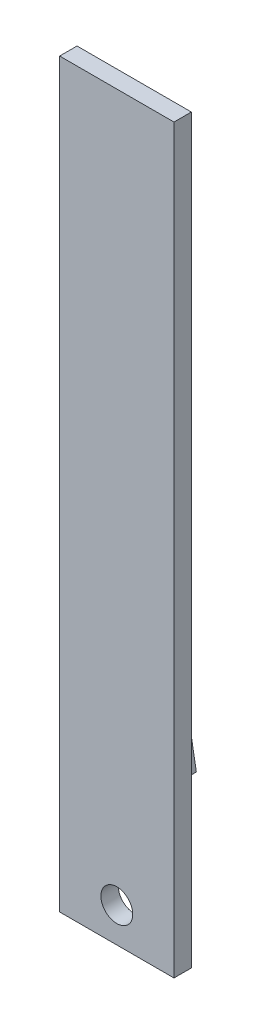
ISO-10303-21;
HEADER;
FILE_DESCRIPTION(('STEP AP214'),'2;1');
FILE_NAME('part.step','',(''),(''),'','','');
FILE_SCHEMA(('AUTOMOTIVE_DESIGN { 1 0 10303 214 1 1 1 1 }'));
ENDSEC;
DATA;
#1=APPLICATION_CONTEXT('core data for automotive mechanical design processes');
#2=APPLICATION_PROTOCOL_DEFINITION('international standard','automotive_design',2000,#1);
#3=PRODUCT_CONTEXT('',#1,'mechanical');
#4=PRODUCT('Part','Part','',(#3));
#5=PRODUCT_RELATED_PRODUCT_CATEGORY('part','',(#4));
#6=PRODUCT_DEFINITION_FORMATION('','',#4);
#7=PRODUCT_DEFINITION_CONTEXT('part definition',#1,'design');
#8=PRODUCT_DEFINITION('design','',#6,#7);
#9=PRODUCT_DEFINITION_SHAPE('','',#8);
#10=(LENGTH_UNIT() NAMED_UNIT(*) SI_UNIT(.MILLI.,.METRE.));
#11=(NAMED_UNIT(*) PLANE_ANGLE_UNIT() SI_UNIT($,.RADIAN.));
#12=(NAMED_UNIT(*) SI_UNIT($,.STERADIAN.) SOLID_ANGLE_UNIT());
#13=UNCERTAINTY_MEASURE_WITH_UNIT(LENGTH_MEASURE(1.E-05),#10,'distance_accuracy_value','');
#14=(GEOMETRIC_REPRESENTATION_CONTEXT(3) GLOBAL_UNCERTAINTY_ASSIGNED_CONTEXT((#13)) GLOBAL_UNIT_ASSIGNED_CONTEXT((#10,
#11,#12)) REPRESENTATION_CONTEXT('',''));
#15=CARTESIAN_POINT('',(0.,0.,0.));
#16=DIRECTION('',(0.,0.,1.));
#17=DIRECTION('',(1.,0.,0.));
#18=AXIS2_PLACEMENT_3D('',#15,#16,#17);
#19=CARTESIAN_POINT('',(0.,0.,3.175));
#20=DIRECTION('',(-1.,0.,0.));
#21=DIRECTION('',(0.,0.,1.));
#22=AXIS2_PLACEMENT_3D('',#19,#20,#21);
#23=PLANE('',#22);
#24=DIRECTION('',(0.,1.,0.));
#25=VECTOR('',#24,1.);
#26=CARTESIAN_POINT('',(0.,0.,0.));
#27=LINE('',#26,#25);
#28=CARTESIAN_POINT('',(0.,0.,0.));
#29=VERTEX_POINT('',#28);
#30=CARTESIAN_POINT('',(0.,135.476524453244,0.));
#31=VERTEX_POINT('',#30);
#32=EDGE_CURVE('E187',#29,#31,#27,.T.);
#33=ORIENTED_EDGE('',*,*,#32,.T.);
#34=DIRECTION('',(0.,0.,-1.));
#35=VECTOR('',#34,1.);
#36=CARTESIAN_POINT('',(0.,135.476524453244,3.175));
#37=LINE('',#36,#35);
#38=CARTESIAN_POINT('',(0.,135.476524453244,3.175));
#39=VERTEX_POINT('',#38);
#40=EDGE_CURVE('E54',#39,#31,#37,.T.);
#41=ORIENTED_EDGE('',*,*,#40,.F.);
#42=DIRECTION('',(0.,1.,0.));
#43=VECTOR('',#42,1.);
#44=CARTESIAN_POINT('',(0.,0.,3.175));
#45=LINE('',#44,#43);
#46=CARTESIAN_POINT('',(0.,0.,3.175));
#47=VERTEX_POINT('',#46);
#48=EDGE_CURVE('E176',#47,#39,#45,.T.);
#49=ORIENTED_EDGE('',*,*,#48,.F.);
#50=DIRECTION('',(0.,0.,-1.));
#51=VECTOR('',#50,1.);
#52=CARTESIAN_POINT('',(0.,0.,3.175));
#53=LINE('',#52,#51);
#54=EDGE_CURVE('E186',#47,#29,#53,.T.);
#55=ORIENTED_EDGE('',*,*,#54,.T.);
#56=EDGE_LOOP('',(#33,#41,#49,#55));
#57=FACE_BOUND('',#56,.T.);
#58=ADVANCED_FACE('F45',(#57),#23,.F.);
#59=CARTESIAN_POINT('',(0.,135.476524453244,3.175));
#60=DIRECTION('',(0.,-1.,0.));
#61=DIRECTION('',(0.,0.,-1.));
#62=AXIS2_PLACEMENT_3D('',#59,#60,#61);
#63=PLANE('',#62);
#64=DIRECTION('',(-1.,0.,0.));
#65=VECTOR('',#64,1.);
#66=CARTESIAN_POINT('',(0.,135.476524453244,0.));
#67=LINE('',#66,#65);
#68=CARTESIAN_POINT('',(-20.8947475915342,135.476524453244,0.));
#69=VERTEX_POINT('',#68);
#70=EDGE_CURVE('E191',#31,#69,#67,.T.);
#71=ORIENTED_EDGE('',*,*,#70,.T.);
#72=DIRECTION('',(0.,0.,-1.));
#73=VECTOR('',#72,1.);
#74=CARTESIAN_POINT('',(-20.8947475915342,135.476524453244,3.175));
#75=LINE('',#74,#73);
#76=CARTESIAN_POINT('',(-20.8947475915342,135.476524453244,3.175));
#77=VERTEX_POINT('',#76);
#78=EDGE_CURVE('E203',#77,#69,#75,.T.);
#79=ORIENTED_EDGE('',*,*,#78,.F.);
#80=DIRECTION('',(-1.,0.,0.));
#81=VECTOR('',#80,1.);
#82=CARTESIAN_POINT('',(0.,135.476524453244,3.175));
#83=LINE('',#82,#81);
#84=EDGE_CURVE('E94',#39,#77,#83,.T.);
#85=ORIENTED_EDGE('',*,*,#84,.F.);
#86=ORIENTED_EDGE('',*,*,#40,.T.);
#87=EDGE_LOOP('',(#71,#79,#85,#86));
#88=FACE_BOUND('',#87,.T.);
#89=ADVANCED_FACE('F232',(#88),#63,.F.);
#90=CARTESIAN_POINT('',(-20.8947475915342,0.,3.175));
#91=DIRECTION('',(1.,0.,0.));
#92=DIRECTION('',(0.,0.,-1.));
#93=AXIS2_PLACEMENT_3D('',#90,#91,#92);
#94=PLANE('',#93);
#95=DIRECTION('',(0.,-1.,0.));
#96=VECTOR('',#95,1.);
#97=CARTESIAN_POINT('',(-20.8947475915342,0.,0.));
#98=LINE('',#97,#96);
#99=CARTESIAN_POINT('',(-20.8947475915342,0.,0.));
#100=VERTEX_POINT('',#99);
#101=EDGE_CURVE('E80',#69,#100,#98,.T.);
#102=ORIENTED_EDGE('',*,*,#101,.T.);
#103=DIRECTION('',(0.,0.,-1.));
#104=VECTOR('',#103,1.);
#105=CARTESIAN_POINT('',(-20.8947475915342,0.,3.175));
#106=LINE('',#105,#104);
#107=CARTESIAN_POINT('',(-20.8947475915342,0.,3.175));
#108=VERTEX_POINT('',#107);
#109=EDGE_CURVE('E200',#108,#100,#106,.T.);
#110=ORIENTED_EDGE('',*,*,#109,.F.);
#111=DIRECTION('',(0.,-1.,0.));
#112=VECTOR('',#111,1.);
#113=CARTESIAN_POINT('',(-20.8947475915342,0.,3.175));
#114=LINE('',#113,#112);
#115=EDGE_CURVE('E181',#77,#108,#114,.T.);
#116=ORIENTED_EDGE('',*,*,#115,.F.);
#117=ORIENTED_EDGE('',*,*,#78,.T.);
#118=EDGE_LOOP('',(#102,#110,#116,#117));
#119=FACE_BOUND('',#118,.T.);
#120=ADVANCED_FACE('F237',(#119),#94,.F.);
#121=CARTESIAN_POINT('',(0.,0.,3.175));
#122=DIRECTION('',(0.,1.,0.));
#123=DIRECTION('',(0.,0.,1.));
#124=AXIS2_PLACEMENT_3D('',#121,#122,#123);
#125=PLANE('',#124);
#126=DIRECTION('',(1.,0.,0.));
#127=VECTOR('',#126,1.);
#128=CARTESIAN_POINT('',(0.,0.,0.));
#129=LINE('',#128,#127);
#130=EDGE_CURVE('E86',#100,#29,#129,.T.);
#131=ORIENTED_EDGE('',*,*,#130,.T.);
#132=ORIENTED_EDGE('',*,*,#54,.F.);
#133=DIRECTION('',(1.,0.,0.));
#134=VECTOR('',#133,1.);
#135=CARTESIAN_POINT('',(0.,0.,3.175));
#136=LINE('',#135,#134);
#137=EDGE_CURVE('E62',#108,#47,#136,.T.);
#138=ORIENTED_EDGE('',*,*,#137,.F.);
#139=ORIENTED_EDGE('',*,*,#109,.T.);
#140=EDGE_LOOP('',(#131,#132,#138,#139));
#141=FACE_BOUND('',#140,.T.);
#142=ADVANCED_FACE('F242',(#141),#125,.F.);
#143=CARTESIAN_POINT('',(0.,0.,3.175));
#144=DIRECTION('',(0.,0.,1.));
#145=DIRECTION('',(1.,0.,0.));
#146=AXIS2_PLACEMENT_3D('',#143,#144,#145);
#147=PLANE('',#146);
#148=CARTESIAN_POINT('',(-10.4473737957671,6.30534767940487,3.175));
#149=DIRECTION('',(0.,0.,-1.));
#150=DIRECTION('',(-1.,0.,0.));
#151=AXIS2_PLACEMENT_3D('',#148,#149,#150);
#152=CIRCLE('',#151,2.91203079532879);
#153=CARTESIAN_POINT('',(-13.3594045910959,6.30534767940487,3.175));
#154=VERTEX_POINT('',#153);
#155=EDGE_CURVE('E166',#154,#154,#152,.T.);
#156=ORIENTED_EDGE('',*,*,#155,.T.);
#157=EDGE_LOOP('',(#156));
#158=FACE_BOUND('',#157,.T.);
#159=ORIENTED_EDGE('',*,*,#48,.T.);
#160=ORIENTED_EDGE('',*,*,#84,.T.);
#161=ORIENTED_EDGE('',*,*,#115,.T.);
#162=ORIENTED_EDGE('',*,*,#137,.T.);
#163=EDGE_LOOP('',(#159,#160,#161,#162));
#164=FACE_BOUND('',#163,.T.);
#165=ADVANCED_FACE('F226',(#158,#164),#147,.T.);
#166=CARTESIAN_POINT('',(0.,0.,0.));
#167=DIRECTION('',(0.,0.,1.));
#168=DIRECTION('',(1.,0.,0.));
#169=AXIS2_PLACEMENT_3D('',#166,#167,#168);
#170=PLANE('',#169);
#171=CARTESIAN_POINT('',(-15.1988975260455,22.4457793566934,0.));
#172=DIRECTION('',(0.,0.,1.));
#173=DIRECTION('',(1.,0.,0.));
#174=AXIS2_PLACEMENT_3D('',#171,#172,#173);
#175=CIRCLE('',#174,3.45002459787095);
#176=CARTESIAN_POINT('',(-11.7488729281745,22.4457793566934,0.));
#177=VERTEX_POINT('',#176);
#178=EDGE_CURVE('E11',#177,#177,#175,.F.);
#179=ORIENTED_EDGE('',*,*,#178,.F.);
#180=EDGE_LOOP('',(#179));
#181=FACE_BOUND('',#180,.T.);
#182=CARTESIAN_POINT('',(-10.4473737957671,6.30534767940487,0.));
#183=DIRECTION('',(0.,0.,1.));
#184=DIRECTION('',(1.,0.,0.));
#185=AXIS2_PLACEMENT_3D('',#182,#183,#184);
#186=CIRCLE('',#185,2.91203079532879);
#187=CARTESIAN_POINT('',(-7.53534300043831,6.30534767940487,0.));
#188=VERTEX_POINT('',#187);
#189=EDGE_CURVE('E175',#188,#188,#186,.T.);
#190=ORIENTED_EDGE('',*,*,#189,.T.);
#191=EDGE_LOOP('',(#190));
#192=FACE_BOUND('',#191,.T.);
#193=ORIENTED_EDGE('',*,*,#32,.F.);
#194=ORIENTED_EDGE('',*,*,#130,.F.);
#195=ORIENTED_EDGE('',*,*,#101,.F.);
#196=ORIENTED_EDGE('',*,*,#70,.F.);
#197=EDGE_LOOP('',(#193,#194,#195,#196));
#198=FACE_BOUND('',#197,.T.);
#199=ADVANCED_FACE('F211',(#181,#192,#198),#170,.F.);
#200=CARTESIAN_POINT('',(-10.4473737957671,6.30534767940487,3.175));
#201=DIRECTION('',(0.,0.,-1.));
#202=DIRECTION('',(-1.,0.,0.));
#203=AXIS2_PLACEMENT_3D('',#200,#201,#202);
#204=CYLINDRICAL_SURFACE('',#203,2.91203079532879);
#205=ORIENTED_EDGE('',*,*,#155,.F.);
#206=EDGE_LOOP('',(#205));
#207=FACE_BOUND('',#206,.T.);
#208=ORIENTED_EDGE('',*,*,#189,.F.);
#209=EDGE_LOOP('',(#208));
#210=FACE_BOUND('',#209,.T.);
#211=ADVANCED_FACE('F214',(#207,#210),#204,.F.);
#212=CARTESIAN_POINT('',(-15.1988975260455,22.4457793566934,-9.65200000000002));
#213=DIRECTION('',(0.,0.,1.));
#214=DIRECTION('',(1.,0.,0.));
#215=AXIS2_PLACEMENT_3D('',#212,#213,#214);
#216=CYLINDRICAL_SURFACE('',#215,3.45002459787095);
#217=CARTESIAN_POINT('',(-15.1988975260455,22.4457793566934,-9.65200000000002));
#218=DIRECTION('',(0.,0.,-1.));
#219=DIRECTION('',(-1.,0.,0.));
#220=AXIS2_PLACEMENT_3D('',#217,#218,#219);
#221=CIRCLE('',#220,3.45002459787095);
#222=CARTESIAN_POINT('',(-18.6489221239165,22.4457793566934,-9.65200000000002));
#223=VERTEX_POINT('',#222);
#224=EDGE_CURVE('E161',#223,#223,#221,.T.);
#225=ORIENTED_EDGE('',*,*,#224,.F.);
#226=EDGE_LOOP('',(#225));
#227=FACE_BOUND('',#226,.T.);
#228=ORIENTED_EDGE('',*,*,#178,.T.);
#229=EDGE_LOOP('',(#228));
#230=FACE_BOUND('',#229,.T.);
#231=ADVANCED_FACE('F216',(#227,#230),#216,.T.);
#232=CARTESIAN_POINT('',(-16.1527036525339,27.8854710511812,-10.922));
#233=DIRECTION('',(-0.34291785687255,-0.939365393996361,0.));
#234=DIRECTION('',(0.939365393996361,-0.34291785687255,0.));
#235=AXIS2_PLACEMENT_3D('',#232,#233,#234);
#236=PLANE('',#235);
#237=DIRECTION('',(0.93936539399636,-0.34291785687255,0.));
#238=VECTOR('',#237,1.);
#239=CARTESIAN_POINT('',(-16.1527036525339,27.8854710511812,-9.65200000000002));
#240=LINE('',#239,#238);
#241=CARTESIAN_POINT('',(-16.1527036525339,27.8854710511812,-9.65200000000002));
#242=VERTEX_POINT('',#241);
#243=CARTESIAN_POINT('',(-10.964889393108,25.9916455397615,-9.65200000000002));
#244=VERTEX_POINT('',#243);
#245=EDGE_CURVE('E159',#242,#244,#240,.T.);
#246=ORIENTED_EDGE('',*,*,#245,.T.);
#247=DIRECTION('',(0.,0.,1.));
#248=VECTOR('',#247,1.);
#249=CARTESIAN_POINT('',(-10.964889393108,25.9916455397615,-10.922));
#250=LINE('',#249,#248);
#251=CARTESIAN_POINT('',(-10.964889393108,25.9916455397615,-10.922));
#252=VERTEX_POINT('',#251);
#253=EDGE_CURVE('E137',#252,#244,#250,.T.);
#254=ORIENTED_EDGE('',*,*,#253,.F.);
#255=DIRECTION('',(0.93936539399636,-0.34291785687255,0.));
#256=VECTOR('',#255,1.);
#257=CARTESIAN_POINT('',(-16.1527036525339,27.8854710511812,-10.922));
#258=LINE('',#257,#256);
#259=CARTESIAN_POINT('',(-16.1527036525339,27.8854710511812,-10.922));
#260=VERTEX_POINT('',#259);
#261=EDGE_CURVE('E145',#260,#252,#258,.T.);
#262=ORIENTED_EDGE('',*,*,#261,.F.);
#263=DIRECTION('',(0.,0.,1.));
#264=VECTOR('',#263,1.);
#265=CARTESIAN_POINT('',(-16.1527036525339,27.8854710511812,-10.922));
#266=LINE('',#265,#264);
#267=EDGE_CURVE('E381',#260,#242,#266,.T.);
#268=ORIENTED_EDGE('',*,*,#267,.T.);
#269=EDGE_LOOP('',(#246,#254,#262,#268));
#270=FACE_BOUND('',#269,.T.);
#271=ADVANCED_FACE('F157',(#270),#236,.F.);
#272=CARTESIAN_POINT('',(-10.964889393108,25.9916455397615,-10.922));
#273=DIRECTION('',(-0.984973223073101,-0.172707121535235,0.));
#274=DIRECTION('',(0.172707121535235,-0.984973223073102,0.));
#275=AXIS2_PLACEMENT_3D('',#272,#273,#274);
#276=PLANE('',#275);
#277=DIRECTION('',(0.172707121535235,-0.984973223073101,0.));
#278=VECTOR('',#277,1.);
#279=CARTESIAN_POINT('',(-10.964889393108,25.9916455397615,-9.65200000000002));
#280=LINE('',#279,#278);
#281=CARTESIAN_POINT('',(-10.0110832666196,20.5519538452736,-9.65200000000002));
#282=VERTEX_POINT('',#281);
#283=EDGE_CURVE('E362',#244,#282,#280,.T.);
#284=ORIENTED_EDGE('',*,*,#283,.T.);
#285=DIRECTION('',(0.,0.,1.));
#286=VECTOR('',#285,1.);
#287=CARTESIAN_POINT('',(-10.0110832666196,20.5519538452736,-10.922));
#288=LINE('',#287,#286);
#289=CARTESIAN_POINT('',(-10.0110832666196,20.5519538452736,-10.922));
#290=VERTEX_POINT('',#289);
#291=EDGE_CURVE('E140',#290,#282,#288,.T.);
#292=ORIENTED_EDGE('',*,*,#291,.F.);
#293=DIRECTION('',(0.172707121535235,-0.984973223073101,0.));
#294=VECTOR('',#293,1.);
#295=CARTESIAN_POINT('',(-10.964889393108,25.9916455397615,-10.922));
#296=LINE('',#295,#294);
#297=EDGE_CURVE('E133',#252,#290,#296,.T.);
#298=ORIENTED_EDGE('',*,*,#297,.F.);
#299=ORIENTED_EDGE('',*,*,#253,.T.);
#300=EDGE_LOOP('',(#284,#292,#298,#299));
#301=FACE_BOUND('',#300,.T.);
#302=ADVANCED_FACE('F135',(#301),#276,.F.);
#303=CARTESIAN_POINT('',(-10.0110832666196,20.5519538452736,-10.922));
#304=DIRECTION('',(-0.642055366200551,0.766658272461125,0.));
#305=DIRECTION('',(-0.766658272461125,-0.642055366200551,0.));
#306=AXIS2_PLACEMENT_3D('',#303,#304,#305);
#307=PLANE('',#306);
#308=DIRECTION('',(-0.766658272461125,-0.642055366200551,0.));
#309=VECTOR('',#308,1.);
#310=CARTESIAN_POINT('',(-10.0110832666196,20.5519538452736,-9.65200000000002));
#311=LINE('',#310,#309);
#312=CARTESIAN_POINT('',(-14.2450913995571,17.0060876622056,-9.65200000000002));
#313=VERTEX_POINT('',#312);
#314=EDGE_CURVE('E366',#282,#313,#311,.T.);
#315=ORIENTED_EDGE('',*,*,#314,.T.);
#316=DIRECTION('',(0.,0.,1.));
#317=VECTOR('',#316,1.);
#318=CARTESIAN_POINT('',(-14.2450913995571,17.0060876622056,-10.922));
#319=LINE('',#318,#317);
#320=CARTESIAN_POINT('',(-14.2450913995571,17.0060876622056,-10.922));
#321=VERTEX_POINT('',#320);
#322=EDGE_CURVE('E168',#321,#313,#319,.T.);
#323=ORIENTED_EDGE('',*,*,#322,.F.);
#324=DIRECTION('',(-0.766658272461125,-0.642055366200551,0.));
#325=VECTOR('',#324,1.);
#326=CARTESIAN_POINT('',(-10.0110832666196,20.5519538452736,-10.922));
#327=LINE('',#326,#325);
#328=EDGE_CURVE('E144',#290,#321,#327,.T.);
#329=ORIENTED_EDGE('',*,*,#328,.F.);
#330=ORIENTED_EDGE('',*,*,#291,.T.);
#331=EDGE_LOOP('',(#315,#323,#329,#330));
#332=FACE_BOUND('',#331,.T.);
#333=ADVANCED_FACE('F297',(#332),#307,.F.);
#334=CARTESIAN_POINT('',(-14.2450913995571,17.0060876622056,-10.922));
#335=DIRECTION('',(0.342917856872551,0.93936539399636,0.));
#336=DIRECTION('',(-0.93936539399636,0.342917856872551,0.));
#337=AXIS2_PLACEMENT_3D('',#334,#335,#336);
#338=PLANE('',#337);
#339=DIRECTION('',(-0.93936539399636,0.342917856872551,0.));
#340=VECTOR('',#339,1.);
#341=CARTESIAN_POINT('',(-14.2450913995571,17.0060876622056,-9.65200000000002));
#342=LINE('',#341,#340);
#343=CARTESIAN_POINT('',(-19.432905658983,18.8999131736253,-9.65200000000002));
#344=VERTEX_POINT('',#343);
#345=EDGE_CURVE('E373',#313,#344,#342,.T.);
#346=ORIENTED_EDGE('',*,*,#345,.T.);
#347=DIRECTION('',(0.,0.,1.));
#348=VECTOR('',#347,1.);
#349=CARTESIAN_POINT('',(-19.432905658983,18.8999131736253,-10.922));
#350=LINE('',#349,#348);
#351=CARTESIAN_POINT('',(-19.432905658983,18.8999131736253,-10.922));
#352=VERTEX_POINT('',#351);
#353=EDGE_CURVE('E388',#352,#344,#350,.T.);
#354=ORIENTED_EDGE('',*,*,#353,.F.);
#355=DIRECTION('',(-0.93936539399636,0.342917856872551,0.));
#356=VECTOR('',#355,1.);
#357=CARTESIAN_POINT('',(-14.2450913995571,17.0060876622056,-10.922));
#358=LINE('',#357,#356);
#359=EDGE_CURVE('E397',#321,#352,#358,.T.);
#360=ORIENTED_EDGE('',*,*,#359,.F.);
#361=ORIENTED_EDGE('',*,*,#322,.T.);
#362=EDGE_LOOP('',(#346,#354,#360,#361));
#363=FACE_BOUND('',#362,.T.);
#364=ADVANCED_FACE('F306',(#363),#338,.F.);
#365=CARTESIAN_POINT('',(-19.432905658983,18.8999131736253,-10.922));
#366=DIRECTION('',(0.984973223073101,0.172707121535236,0.));
#367=DIRECTION('',(-0.172707121535236,0.984973223073101,0.));
#368=AXIS2_PLACEMENT_3D('',#365,#366,#367);
#369=PLANE('',#368);
#370=DIRECTION('',(-0.172707121535236,0.984973223073101,0.));
#371=VECTOR('',#370,1.);
#372=CARTESIAN_POINT('',(-19.432905658983,18.8999131736253,-9.65200000000002));
#373=LINE('',#372,#371);
#374=CARTESIAN_POINT('',(-20.3867117854714,24.3396048681132,-9.65200000000002));
#375=VERTEX_POINT('',#374);
#376=EDGE_CURVE('E376',#344,#375,#373,.T.);
#377=ORIENTED_EDGE('',*,*,#376,.T.);
#378=DIRECTION('',(0.,0.,1.));
#379=VECTOR('',#378,1.);
#380=CARTESIAN_POINT('',(-20.3867117854714,24.3396048681132,-10.922));
#381=LINE('',#380,#379);
#382=CARTESIAN_POINT('',(-20.3867117854714,24.3396048681132,-10.922));
#383=VERTEX_POINT('',#382);
#384=EDGE_CURVE('E384',#383,#375,#381,.T.);
#385=ORIENTED_EDGE('',*,*,#384,.F.);
#386=DIRECTION('',(-0.172707121535236,0.984973223073101,0.));
#387=VECTOR('',#386,1.);
#388=CARTESIAN_POINT('',(-19.432905658983,18.8999131736253,-10.922));
#389=LINE('',#388,#387);
#390=EDGE_CURVE('E401',#352,#383,#389,.T.);
#391=ORIENTED_EDGE('',*,*,#390,.F.);
#392=ORIENTED_EDGE('',*,*,#353,.T.);
#393=EDGE_LOOP('',(#377,#385,#391,#392));
#394=FACE_BOUND('',#393,.T.);
#395=ADVANCED_FACE('F316',(#394),#369,.F.);
#396=CARTESIAN_POINT('',(-20.3867117854714,24.3396048681132,-10.922));
#397=DIRECTION('',(0.642055366200551,-0.766658272461125,0.));
#398=DIRECTION('',(0.766658272461125,0.642055366200551,0.));
#399=AXIS2_PLACEMENT_3D('',#396,#397,#398);
#400=PLANE('',#399);
#401=DIRECTION('',(0.766658272461125,0.642055366200551,0.));
#402=VECTOR('',#401,1.);
#403=CARTESIAN_POINT('',(-20.3867117854714,24.3396048681132,-9.65200000000002));
#404=LINE('',#403,#402);
#405=EDGE_CURVE('E155',#375,#242,#404,.T.);
#406=ORIENTED_EDGE('',*,*,#405,.T.);
#407=ORIENTED_EDGE('',*,*,#267,.F.);
#408=DIRECTION('',(0.766658272461125,0.642055366200551,0.));
#409=VECTOR('',#408,1.);
#410=CARTESIAN_POINT('',(-20.3867117854714,24.3396048681132,-10.922));
#411=LINE('',#410,#409);
#412=EDGE_CURVE('E150',#383,#260,#411,.T.);
#413=ORIENTED_EDGE('',*,*,#412,.F.);
#414=ORIENTED_EDGE('',*,*,#384,.T.);
#415=EDGE_LOOP('',(#406,#407,#413,#414));
#416=FACE_BOUND('',#415,.T.);
#417=ADVANCED_FACE('F326',(#416),#400,.F.);
#418=CARTESIAN_POINT('',(0.,0.,-10.922));
#419=DIRECTION('',(0.,0.,-1.));
#420=DIRECTION('',(-1.,0.,0.));
#421=AXIS2_PLACEMENT_3D('',#418,#419,#420);
#422=PLANE('',#421);
#423=ORIENTED_EDGE('',*,*,#261,.T.);
#424=ORIENTED_EDGE('',*,*,#297,.T.);
#425=ORIENTED_EDGE('',*,*,#328,.T.);
#426=ORIENTED_EDGE('',*,*,#359,.T.);
#427=ORIENTED_EDGE('',*,*,#390,.T.);
#428=ORIENTED_EDGE('',*,*,#412,.T.);
#429=EDGE_LOOP('',(#423,#424,#425,#426,#427,#428));
#430=FACE_BOUND('',#429,.T.);
#431=ADVANCED_FACE('F148',(#430),#422,.T.);
#432=CARTESIAN_POINT('',(0.,0.,-9.65200000000002));
#433=DIRECTION('',(0.,0.,-1.));
#434=DIRECTION('',(-1.,0.,0.));
#435=AXIS2_PLACEMENT_3D('',#432,#433,#434);
#436=PLANE('',#435);
#437=ORIENTED_EDGE('',*,*,#224,.T.);
#438=EDGE_LOOP('',(#437));
#439=FACE_BOUND('',#438,.T.);
#440=ORIENTED_EDGE('',*,*,#245,.F.);
#441=ORIENTED_EDGE('',*,*,#405,.F.);
#442=ORIENTED_EDGE('',*,*,#376,.F.);
#443=ORIENTED_EDGE('',*,*,#345,.F.);
#444=ORIENTED_EDGE('',*,*,#314,.F.);
#445=ORIENTED_EDGE('',*,*,#283,.F.);
#446=EDGE_LOOP('',(#440,#441,#442,#443,#444,#445));
#447=FACE_BOUND('',#446,.T.);
#448=ADVANCED_FACE('F345',(#439,#447),#436,.F.);
#449=CLOSED_SHELL('',(#58,#89,#120,#142,#165,#199,#211,#231,#271,#302,#333,#364,#395,#417,#431,#448));
#450=MANIFOLD_SOLID_BREP('B2',#449);
#451=ADVANCED_BREP_SHAPE_REPRESENTATION('',(#18,#450),#14);
#452=SHAPE_DEFINITION_REPRESENTATION(#9,#451);
ENDSEC;
END-ISO-10303-21;
